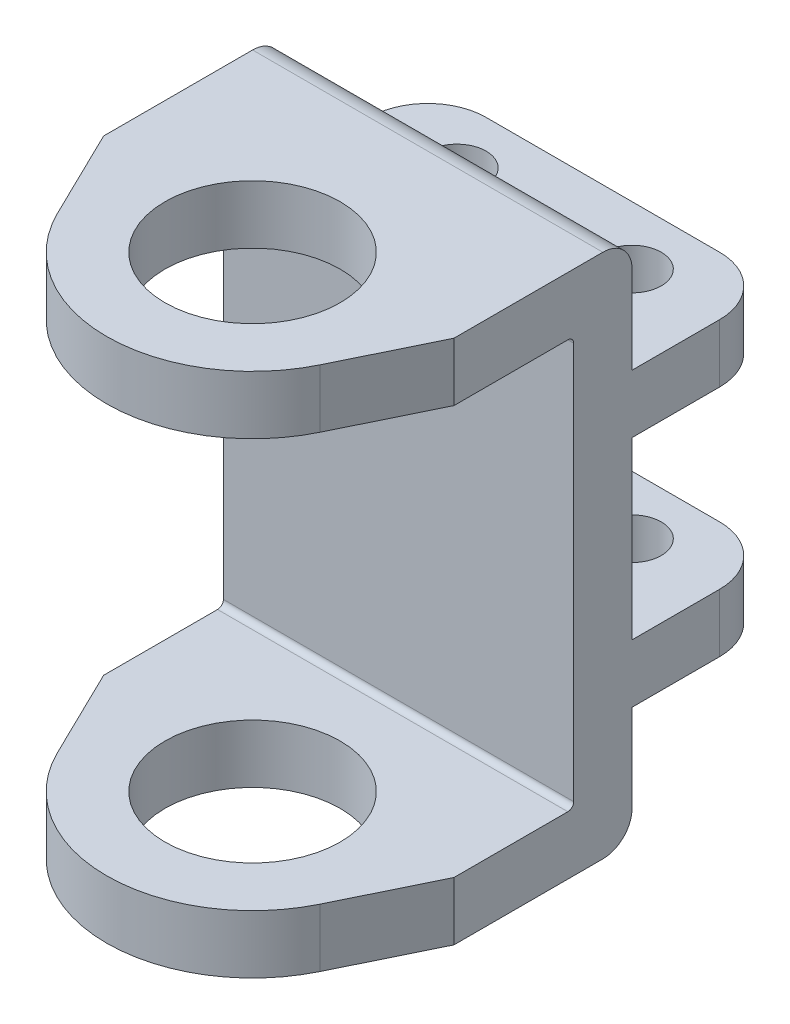
ISO-10303-21;
HEADER;
FILE_DESCRIPTION(('STEP AP214'),'2;1');
FILE_NAME('part.step','',(''),(''),'','','');
FILE_SCHEMA(('AUTOMOTIVE_DESIGN { 1 0 10303 214 1 1 1 1 }'));
ENDSEC;
DATA;
#1=APPLICATION_CONTEXT('core data for automotive mechanical design processes');
#2=APPLICATION_PROTOCOL_DEFINITION('international standard','automotive_design',2000,#1);
#3=PRODUCT_CONTEXT('',#1,'mechanical');
#4=PRODUCT('Part','Part','',(#3));
#5=PRODUCT_RELATED_PRODUCT_CATEGORY('part','',(#4));
#6=PRODUCT_DEFINITION_FORMATION('','',#4);
#7=PRODUCT_DEFINITION_CONTEXT('part definition',#1,'design');
#8=PRODUCT_DEFINITION('design','',#6,#7);
#9=PRODUCT_DEFINITION_SHAPE('','',#8);
#10=(LENGTH_UNIT() NAMED_UNIT(*) SI_UNIT(.MILLI.,.METRE.));
#11=(NAMED_UNIT(*) PLANE_ANGLE_UNIT() SI_UNIT($,.RADIAN.));
#12=(NAMED_UNIT(*) SI_UNIT($,.STERADIAN.) SOLID_ANGLE_UNIT());
#13=UNCERTAINTY_MEASURE_WITH_UNIT(LENGTH_MEASURE(1.E-05),#10,'distance_accuracy_value','');
#14=(GEOMETRIC_REPRESENTATION_CONTEXT(3) GLOBAL_UNCERTAINTY_ASSIGNED_CONTEXT((#13)) GLOBAL_UNIT_ASSIGNED_CONTEXT((#10,
#11,#12)) REPRESENTATION_CONTEXT('',''));
#15=CARTESIAN_POINT('',(0.,0.,0.));
#16=DIRECTION('',(0.,0.,1.));
#17=DIRECTION('',(1.,0.,0.));
#18=AXIS2_PLACEMENT_3D('',#15,#16,#17);
#19=CARTESIAN_POINT('',(20.0000000000001,90.,-32.5));
#20=DIRECTION('',(0.,-1.,0.));
#21=DIRECTION('',(0.,0.,-1.));
#22=AXIS2_PLACEMENT_3D('',#19,#20,#21);
#23=CYLINDRICAL_SURFACE('',#22,10.);
#24=DIRECTION('',(0.,-1.,0.));
#25=VECTOR('',#24,1.);
#26=CARTESIAN_POINT('',(20.,90.,-42.5));
#27=LINE('',#26,#25);
#28=CARTESIAN_POINT('',(20.,30.,-42.5));
#29=VERTEX_POINT('',#28);
#30=CARTESIAN_POINT('',(20.,20.,-42.5));
#31=VERTEX_POINT('',#30);
#32=EDGE_CURVE('E438',#29,#31,#27,.T.);
#33=ORIENTED_EDGE('',*,*,#32,.F.);
#34=CARTESIAN_POINT('',(20.0000000000001,30.,-32.5));
#35=DIRECTION('',(0.,-1.,0.));
#36=DIRECTION('',(0.,0.,-1.));
#37=AXIS2_PLACEMENT_3D('',#34,#35,#36);
#38=CIRCLE('',#37,10.);
#39=CARTESIAN_POINT('',(30.0000000000001,30.,-32.4999999999999));
#40=VERTEX_POINT('',#39);
#41=EDGE_CURVE('E378',#29,#40,#38,.T.);
#42=ORIENTED_EDGE('',*,*,#41,.T.);
#43=DIRECTION('',(0.,-1.,0.));
#44=VECTOR('',#43,1.);
#45=CARTESIAN_POINT('',(30.0000000000001,90.,-32.4999999999999));
#46=LINE('',#45,#44);
#47=CARTESIAN_POINT('',(30.0000000000001,20.,-32.4999999999999));
#48=VERTEX_POINT('',#47);
#49=EDGE_CURVE('E399',#40,#48,#46,.T.);
#50=ORIENTED_EDGE('',*,*,#49,.T.);
#51=CARTESIAN_POINT('',(20.0000000000001,20.,-32.5));
#52=DIRECTION('',(0.,1.,0.));
#53=DIRECTION('',(0.,0.,1.));
#54=AXIS2_PLACEMENT_3D('',#51,#52,#53);
#55=CIRCLE('',#54,10.);
#56=EDGE_CURVE('E358',#48,#31,#55,.T.);
#57=ORIENTED_EDGE('',*,*,#56,.T.);
#58=EDGE_LOOP('',(#33,#42,#50,#57));
#59=FACE_BOUND('',#58,.T.);
#60=ADVANCED_FACE('F34',(#59),#23,.T.);
#61=CARTESIAN_POINT('',(20.,90.,-42.5));
#62=DIRECTION('',(0.,0.,1.));
#63=DIRECTION('',(1.,0.,0.));
#64=AXIS2_PLACEMENT_3D('',#61,#62,#63);
#65=PLANE('',#64);
#66=DIRECTION('',(0.,-1.,0.));
#67=VECTOR('',#66,1.);
#68=CARTESIAN_POINT('',(-19.9999999999999,90.,-42.5));
#69=LINE('',#68,#67);
#70=CARTESIAN_POINT('',(-19.9999999999999,30.,-42.5));
#71=VERTEX_POINT('',#70);
#72=CARTESIAN_POINT('',(-19.9999999999999,20.,-42.5));
#73=VERTEX_POINT('',#72);
#74=EDGE_CURVE('E434',#71,#73,#69,.T.);
#75=ORIENTED_EDGE('',*,*,#74,.F.);
#76=DIRECTION('',(1.,0.,0.));
#77=VECTOR('',#76,1.);
#78=CARTESIAN_POINT('',(-30.,30.,-42.5));
#79=LINE('',#78,#77);
#80=EDGE_CURVE('E286',#71,#29,#79,.T.);
#81=ORIENTED_EDGE('',*,*,#80,.T.);
#82=ORIENTED_EDGE('',*,*,#32,.T.);
#83=DIRECTION('',(1.,0.,0.));
#84=VECTOR('',#83,1.);
#85=CARTESIAN_POINT('',(-30.,20.,-42.5));
#86=LINE('',#85,#84);
#87=EDGE_CURVE('E317',#73,#31,#86,.T.);
#88=ORIENTED_EDGE('',*,*,#87,.F.);
#89=EDGE_LOOP('',(#75,#81,#82,#88));
#90=FACE_BOUND('',#89,.T.);
#91=ADVANCED_FACE('F513',(#90),#65,.F.);
#92=CARTESIAN_POINT('',(-19.9999999999999,90.,-32.5));
#93=DIRECTION('',(0.,-1.,0.));
#94=DIRECTION('',(0.,0.,-1.));
#95=AXIS2_PLACEMENT_3D('',#92,#93,#94);
#96=CYLINDRICAL_SURFACE('',#95,10.);
#97=DIRECTION('',(0.,-1.,0.));
#98=VECTOR('',#97,1.);
#99=CARTESIAN_POINT('',(-29.9999999999999,90.,-32.4999999999999));
#100=LINE('',#99,#98);
#101=CARTESIAN_POINT('',(-30.,30.,-32.4999999999999));
#102=VERTEX_POINT('',#101);
#103=CARTESIAN_POINT('',(-30.,20.,-32.4999999999999));
#104=VERTEX_POINT('',#103);
#105=EDGE_CURVE('E430',#102,#104,#100,.T.);
#106=ORIENTED_EDGE('',*,*,#105,.F.);
#107=CARTESIAN_POINT('',(-19.9999999999999,30.,-32.5));
#108=DIRECTION('',(0.,-1.,0.));
#109=DIRECTION('',(0.,0.,-1.));
#110=AXIS2_PLACEMENT_3D('',#107,#108,#109);
#111=CIRCLE('',#110,10.);
#112=EDGE_CURVE('E375',#102,#71,#111,.T.);
#113=ORIENTED_EDGE('',*,*,#112,.T.);
#114=ORIENTED_EDGE('',*,*,#74,.T.);
#115=CARTESIAN_POINT('',(-19.9999999999999,20.,-32.5));
#116=DIRECTION('',(0.,1.,0.));
#117=DIRECTION('',(0.,0.,1.));
#118=AXIS2_PLACEMENT_3D('',#115,#116,#117);
#119=CIRCLE('',#118,10.);
#120=EDGE_CURVE('E355',#73,#104,#119,.T.);
#121=ORIENTED_EDGE('',*,*,#120,.T.);
#122=EDGE_LOOP('',(#106,#113,#114,#121));
#123=FACE_BOUND('',#122,.T.);
#124=ADVANCED_FACE('F507',(#123),#96,.T.);
#125=CARTESIAN_POINT('',(-30.,90.,13.012820512795));
#126=DIRECTION('',(0.898876404494167,0.,-0.438202247191452));
#127=DIRECTION('',(-0.438202247191452,0.,-0.898876404494168));
#128=AXIS2_PLACEMENT_3D('',#125,#126,#127);
#129=PLANE('',#128);
#130=DIRECTION('',(0.,-1.,0.));
#131=VECTOR('',#130,1.);
#132=CARTESIAN_POINT('',(-30.,90.,13.012820512795));
#133=LINE('',#132,#131);
#134=CARTESIAN_POINT('',(-30.,90.,13.012820512795));
#135=VERTEX_POINT('',#134);
#136=CARTESIAN_POINT('',(-30.0000000000001,80.,13.012820512795));
#137=VERTEX_POINT('',#136);
#138=EDGE_CURVE('E427',#135,#137,#133,.T.);
#139=ORIENTED_EDGE('',*,*,#138,.T.);
#140=DIRECTION('',(0.438202247191452,0.,0.898876404494168));
#141=VECTOR('',#140,1.);
#142=CARTESIAN_POINT('',(-30.,80.,13.012820512795));
#143=LINE('',#142,#141);
#144=CARTESIAN_POINT('',(-22.4719101123365,80.,28.4550561797778));
#145=VERTEX_POINT('',#144);
#146=EDGE_CURVE('E338',#137,#145,#143,.T.);
#147=ORIENTED_EDGE('',*,*,#146,.T.);
#148=DIRECTION('',(0.,-1.,0.));
#149=VECTOR('',#148,1.);
#150=CARTESIAN_POINT('',(-22.4719101123365,90.,28.4550561797778));
#151=LINE('',#150,#149);
#152=CARTESIAN_POINT('',(-22.4719101123365,90.,28.4550561797778));
#153=VERTEX_POINT('',#152);
#154=EDGE_CURVE('E424',#153,#145,#151,.T.);
#155=ORIENTED_EDGE('',*,*,#154,.F.);
#156=DIRECTION('',(0.438202247191452,0.,0.898876404494167));
#157=VECTOR('',#156,1.);
#158=CARTESIAN_POINT('',(-30.,90.,13.012820512795));
#159=LINE('',#158,#157);
#160=EDGE_CURVE('E390',#135,#153,#159,.T.);
#161=ORIENTED_EDGE('',*,*,#160,.F.);
#162=EDGE_LOOP('',(#139,#147,#155,#161));
#163=FACE_BOUND('',#162,.T.);
#164=ADVANCED_FACE('F559',(#163),#129,.F.);
#165=CARTESIAN_POINT('',(0.,90.,17.5000000000001));
#166=DIRECTION('',(0.,-1.,0.));
#167=DIRECTION('',(0.,0.,-1.));
#168=AXIS2_PLACEMENT_3D('',#165,#166,#167);
#169=CYLINDRICAL_SURFACE('',#168,24.9999999999804);
#170=CARTESIAN_POINT('',(0.,80.,17.5000000000001));
#171=DIRECTION('',(0.,1.,0.));
#172=DIRECTION('',(0.,0.,1.));
#173=AXIS2_PLACEMENT_3D('',#170,#171,#172);
#174=CIRCLE('',#173,24.9999999999804);
#175=CARTESIAN_POINT('',(22.4719101123366,80.,28.4550561797778));
#176=VERTEX_POINT('',#175);
#177=EDGE_CURVE('E336',#145,#176,#174,.T.);
#178=ORIENTED_EDGE('',*,*,#177,.T.);
#179=DIRECTION('',(0.,-1.,0.));
#180=VECTOR('',#179,1.);
#181=CARTESIAN_POINT('',(22.4719101123366,90.,28.4550561797778));
#182=LINE('',#181,#180);
#183=CARTESIAN_POINT('',(22.4719101123366,90.,28.4550561797778));
#184=VERTEX_POINT('',#183);
#185=EDGE_CURVE('E420',#184,#176,#182,.T.);
#186=ORIENTED_EDGE('',*,*,#185,.F.);
#187=CARTESIAN_POINT('',(0.,90.,17.5000000000001));
#188=DIRECTION('',(0.,1.,0.));
#189=DIRECTION('',(0.,0.,1.));
#190=AXIS2_PLACEMENT_3D('',#187,#188,#189);
#191=CIRCLE('',#190,24.9999999999804);
#192=EDGE_CURVE('E393',#153,#184,#191,.T.);
#193=ORIENTED_EDGE('',*,*,#192,.F.);
#194=ORIENTED_EDGE('',*,*,#154,.T.);
#195=EDGE_LOOP('',(#178,#186,#193,#194));
#196=FACE_BOUND('',#195,.T.);
#197=ADVANCED_FACE('F563',(#196),#169,.T.);
#198=CARTESIAN_POINT('',(30.0000000000001,90.,13.012820512795));
#199=DIRECTION('',(-0.898876404494167,0.,-0.438202247191452));
#200=DIRECTION('',(-0.438202247191452,0.,0.898876404494167));
#201=AXIS2_PLACEMENT_3D('',#198,#199,#200);
#202=PLANE('',#201);
#203=ORIENTED_EDGE('',*,*,#185,.T.);
#204=DIRECTION('',(0.438202247191452,0.,-0.898876404494167));
#205=VECTOR('',#204,1.);
#206=CARTESIAN_POINT('',(30.0000000000001,80.,13.012820512795));
#207=LINE('',#206,#205);
#208=CARTESIAN_POINT('',(30.,80.,13.012820512795));
#209=VERTEX_POINT('',#208);
#210=EDGE_CURVE('E333',#176,#209,#207,.T.);
#211=ORIENTED_EDGE('',*,*,#210,.T.);
#212=DIRECTION('',(0.,-1.,0.));
#213=VECTOR('',#212,1.);
#214=CARTESIAN_POINT('',(30.0000000000001,90.,13.012820512795));
#215=LINE('',#214,#213);
#216=CARTESIAN_POINT('',(30.0000000000001,90.,13.012820512795));
#217=VERTEX_POINT('',#216);
#218=EDGE_CURVE('E415',#217,#209,#215,.T.);
#219=ORIENTED_EDGE('',*,*,#218,.F.);
#220=DIRECTION('',(0.438202247191452,0.,-0.898876404494167));
#221=VECTOR('',#220,1.);
#222=CARTESIAN_POINT('',(30.0000000000001,90.,13.012820512795));
#223=LINE('',#222,#221);
#224=EDGE_CURVE('E395',#184,#217,#223,.T.);
#225=ORIENTED_EDGE('',*,*,#224,.F.);
#226=EDGE_LOOP('',(#203,#211,#219,#225));
#227=FACE_BOUND('',#226,.T.);
#228=ADVANCED_FACE('F598',(#227),#202,.F.);
#229=CARTESIAN_POINT('',(0.,90.,17.5000000000001));
#230=DIRECTION('',(0.,-1.,0.));
#231=DIRECTION('',(0.,0.,-1.));
#232=AXIS2_PLACEMENT_3D('',#229,#230,#231);
#233=CYLINDRICAL_SURFACE('',#232,15.);
#234=CARTESIAN_POINT('',(0.,80.,17.5000000000001));
#235=DIRECTION('',(0.,1.,0.));
#236=DIRECTION('',(0.,0.,1.));
#237=AXIS2_PLACEMENT_3D('',#234,#235,#236);
#238=CIRCLE('',#237,15.);
#239=CARTESIAN_POINT('',(0.,80.,32.5000000000001));
#240=VERTEX_POINT('',#239);
#241=EDGE_CURVE('E332',#240,#240,#238,.T.);
#242=ORIENTED_EDGE('',*,*,#241,.F.);
#243=EDGE_LOOP('',(#242));
#244=FACE_BOUND('',#243,.T.);
#245=CARTESIAN_POINT('',(0.,90.,17.5000000000001));
#246=DIRECTION('',(0.,1.,0.));
#247=DIRECTION('',(0.,0.,1.));
#248=AXIS2_PLACEMENT_3D('',#245,#246,#247);
#249=CIRCLE('',#248,15.);
#250=CARTESIAN_POINT('',(0.,90.,32.5000000000001));
#251=VERTEX_POINT('',#250);
#252=EDGE_CURVE('E382',#251,#251,#249,.T.);
#253=ORIENTED_EDGE('',*,*,#252,.T.);
#254=EDGE_LOOP('',(#253));
#255=FACE_BOUND('',#254,.T.);
#256=ADVANCED_FACE('F589',(#244,#255),#233,.F.);
#257=CARTESIAN_POINT('',(20.0000000000001,90.,-32.5));
#258=DIRECTION('',(0.,1.,0.));
#259=DIRECTION('',(0.,0.,1.));
#260=AXIS2_PLACEMENT_3D('',#257,#258,#259);
#261=PLANE('',#260);
#262=DIRECTION('',(0.,0.,-1.));
#263=VECTOR('',#262,1.);
#264=CARTESIAN_POINT('',(30.,90.,0.));
#265=LINE('',#264,#263);
#266=CARTESIAN_POINT('',(30.,90.,-12.4999999999999));
#267=VERTEX_POINT('',#266);
#268=EDGE_CURVE('E397',#217,#267,#265,.T.);
#269=ORIENTED_EDGE('',*,*,#268,.T.);
#270=DIRECTION('',(1.,0.,0.));
#271=VECTOR('',#270,1.);
#272=CARTESIAN_POINT('',(-30.,90.,-12.5));
#273=LINE('',#272,#271);
#274=CARTESIAN_POINT('',(-30.,90.,-12.5));
#275=VERTEX_POINT('',#274);
#276=EDGE_CURVE('E11',#267,#275,#273,.F.);
#277=ORIENTED_EDGE('',*,*,#276,.T.);
#278=DIRECTION('',(0.,0.,1.));
#279=VECTOR('',#278,1.);
#280=CARTESIAN_POINT('',(-30.,90.,0.));
#281=LINE('',#280,#279);
#282=EDGE_CURVE('E388',#275,#135,#281,.T.);
#283=ORIENTED_EDGE('',*,*,#282,.T.);
#284=ORIENTED_EDGE('',*,*,#160,.T.);
#285=ORIENTED_EDGE('',*,*,#192,.T.);
#286=ORIENTED_EDGE('',*,*,#224,.T.);
#287=EDGE_LOOP('',(#269,#277,#283,#284,#285,#286));
#288=FACE_BOUND('',#287,.T.);
#289=ORIENTED_EDGE('',*,*,#252,.F.);
#290=EDGE_LOOP('',(#289));
#291=FACE_BOUND('',#290,.T.);
#292=ADVANCED_FACE('F566',(#288,#291),#261,.T.);
#293=CARTESIAN_POINT('',(20.0000000000001,0.,-32.5));
#294=DIRECTION('',(0.,1.,0.));
#295=DIRECTION('',(0.,0.,1.));
#296=AXIS2_PLACEMENT_3D('',#293,#294,#295);
#297=PLANE('',#296);
#298=DIRECTION('',(0.,0.,1.));
#299=VECTOR('',#298,1.);
#300=CARTESIAN_POINT('',(-30.,0.,0.));
#301=LINE('',#300,#299);
#302=CARTESIAN_POINT('',(-30.,0.,-12.5));
#303=VERTEX_POINT('',#302);
#304=CARTESIAN_POINT('',(-30.,0.,13.012820512795));
#305=VERTEX_POINT('',#304);
#306=EDGE_CURVE('E385',#303,#305,#301,.T.);
#307=ORIENTED_EDGE('',*,*,#306,.F.);
#308=DIRECTION('',(1.,0.,0.));
#309=VECTOR('',#308,1.);
#310=CARTESIAN_POINT('',(20.,0.,-12.4999999999999));
#311=LINE('',#310,#309);
#312=CARTESIAN_POINT('',(30.,0.,-12.4999999999999));
#313=VERTEX_POINT('',#312);
#314=EDGE_CURVE('E454',#303,#313,#311,.T.);
#315=ORIENTED_EDGE('',*,*,#314,.T.);
#316=DIRECTION('',(0.,0.,-1.));
#317=VECTOR('',#316,1.);
#318=CARTESIAN_POINT('',(30.,0.,0.));
#319=LINE('',#318,#317);
#320=CARTESIAN_POINT('',(30.0000000000001,0.,13.012820512795));
#321=VERTEX_POINT('',#320);
#322=EDGE_CURVE('E391',#321,#313,#319,.T.);
#323=ORIENTED_EDGE('',*,*,#322,.F.);
#324=DIRECTION('',(0.438202247191452,0.,-0.898876404494167));
#325=VECTOR('',#324,1.);
#326=CARTESIAN_POINT('',(30.0000000000001,0.,13.012820512795));
#327=LINE('',#326,#325);
#328=CARTESIAN_POINT('',(22.4719101123366,0.,28.4550561797778));
#329=VERTEX_POINT('',#328);
#330=EDGE_CURVE('E407',#329,#321,#327,.T.);
#331=ORIENTED_EDGE('',*,*,#330,.F.);
#332=CARTESIAN_POINT('',(0.,0.,17.5000000000001));
#333=DIRECTION('',(0.,1.,0.));
#334=DIRECTION('',(0.,0.,1.));
#335=AXIS2_PLACEMENT_3D('',#332,#333,#334);
#336=CIRCLE('',#335,24.9999999999804);
#337=CARTESIAN_POINT('',(-22.4719101123365,0.,28.4550561797778));
#338=VERTEX_POINT('',#337);
#339=EDGE_CURVE('E404',#338,#329,#336,.T.);
#340=ORIENTED_EDGE('',*,*,#339,.F.);
#341=DIRECTION('',(0.438202247191452,0.,0.898876404494167));
#342=VECTOR('',#341,1.);
#343=CARTESIAN_POINT('',(-30.,0.,13.012820512795));
#344=LINE('',#343,#342);
#345=EDGE_CURVE('E401',#305,#338,#344,.T.);
#346=ORIENTED_EDGE('',*,*,#345,.F.);
#347=EDGE_LOOP('',(#307,#315,#323,#331,#340,#346));
#348=FACE_BOUND('',#347,.T.);
#349=CARTESIAN_POINT('',(0.,0.,17.5000000000001));
#350=DIRECTION('',(0.,1.,0.));
#351=DIRECTION('',(0.,0.,1.));
#352=AXIS2_PLACEMENT_3D('',#349,#350,#351);
#353=CIRCLE('',#352,15.);
#354=CARTESIAN_POINT('',(0.,0.,32.5000000000001));
#355=VERTEX_POINT('',#354);
#356=EDGE_CURVE('E381',#355,#355,#353,.T.);
#357=ORIENTED_EDGE('',*,*,#356,.T.);
#358=EDGE_LOOP('',(#357));
#359=FACE_BOUND('',#358,.T.);
#360=ADVANCED_FACE('F530',(#348,#359),#297,.F.);
#361=CARTESIAN_POINT('',(30.0000000000001,70.,-32.4999999999999));
#362=VERTEX_POINT('',#361);
#363=CARTESIAN_POINT('',(30.0000000000001,60.,-32.4999999999999));
#364=VERTEX_POINT('',#363);
#365=EDGE_CURVE('E414',#362,#364,#46,.T.);
#366=ORIENTED_EDGE('',*,*,#365,.T.);
#367=CARTESIAN_POINT('',(20.0000000000001,60.,-32.5));
#368=DIRECTION('',(0.,1.,0.));
#369=DIRECTION('',(0.,0.,1.));
#370=AXIS2_PLACEMENT_3D('',#367,#368,#369);
#371=CIRCLE('',#370,10.);
#372=CARTESIAN_POINT('',(20.,60.,-42.5));
#373=VERTEX_POINT('',#372);
#374=EDGE_CURVE('E368',#364,#373,#371,.T.);
#375=ORIENTED_EDGE('',*,*,#374,.T.);
#376=CARTESIAN_POINT('',(20.,70.,-42.5));
#377=VERTEX_POINT('',#376);
#378=EDGE_CURVE('E441',#377,#373,#27,.T.);
#379=ORIENTED_EDGE('',*,*,#378,.F.);
#380=CARTESIAN_POINT('',(20.0000000000001,70.,-32.5));
#381=DIRECTION('',(0.,-1.,0.));
#382=DIRECTION('',(0.,0.,-1.));
#383=AXIS2_PLACEMENT_3D('',#380,#381,#382);
#384=CIRCLE('',#383,10.);
#385=EDGE_CURVE('E348',#377,#362,#384,.T.);
#386=ORIENTED_EDGE('',*,*,#385,.T.);
#387=EDGE_LOOP('',(#366,#375,#379,#386));
#388=FACE_BOUND('',#387,.T.);
#389=ADVANCED_FACE('F484',(#388),#23,.T.);
#390=ORIENTED_EDGE('',*,*,#378,.T.);
#391=DIRECTION('',(1.,0.,0.));
#392=VECTOR('',#391,1.);
#393=CARTESIAN_POINT('',(-30.,60.,-42.5));
#394=LINE('',#393,#392);
#395=CARTESIAN_POINT('',(-19.9999999999999,60.,-42.5));
#396=VERTEX_POINT('',#395);
#397=EDGE_CURVE('E279',#396,#373,#394,.T.);
#398=ORIENTED_EDGE('',*,*,#397,.F.);
#399=CARTESIAN_POINT('',(-19.9999999999999,70.,-42.5));
#400=VERTEX_POINT('',#399);
#401=EDGE_CURVE('E437',#400,#396,#69,.T.);
#402=ORIENTED_EDGE('',*,*,#401,.F.);
#403=DIRECTION('',(1.,0.,0.));
#404=VECTOR('',#403,1.);
#405=CARTESIAN_POINT('',(-30.,70.,-42.5));
#406=LINE('',#405,#404);
#407=EDGE_CURVE('E256',#400,#377,#406,.T.);
#408=ORIENTED_EDGE('',*,*,#407,.T.);
#409=EDGE_LOOP('',(#390,#398,#402,#408));
#410=FACE_BOUND('',#409,.T.);
#411=ADVANCED_FACE('F488',(#410),#65,.F.);
#412=ORIENTED_EDGE('',*,*,#401,.T.);
#413=CARTESIAN_POINT('',(-19.9999999999999,60.,-32.5));
#414=DIRECTION('',(0.,1.,0.));
#415=DIRECTION('',(0.,0.,1.));
#416=AXIS2_PLACEMENT_3D('',#413,#414,#415);
#417=CIRCLE('',#416,10.);
#418=CARTESIAN_POINT('',(-30.,60.,-32.4999999999999));
#419=VERTEX_POINT('',#418);
#420=EDGE_CURVE('E365',#396,#419,#417,.T.);
#421=ORIENTED_EDGE('',*,*,#420,.T.);
#422=CARTESIAN_POINT('',(-30.,70.,-32.4999999999999));
#423=VERTEX_POINT('',#422);
#424=EDGE_CURVE('E433',#423,#419,#100,.T.);
#425=ORIENTED_EDGE('',*,*,#424,.F.);
#426=CARTESIAN_POINT('',(-19.9999999999999,70.,-32.5));
#427=DIRECTION('',(0.,-1.,0.));
#428=DIRECTION('',(0.,0.,-1.));
#429=AXIS2_PLACEMENT_3D('',#426,#427,#428);
#430=CIRCLE('',#429,10.);
#431=EDGE_CURVE('E345',#423,#400,#430,.T.);
#432=ORIENTED_EDGE('',*,*,#431,.T.);
#433=EDGE_LOOP('',(#412,#421,#425,#432));
#434=FACE_BOUND('',#433,.T.);
#435=ADVANCED_FACE('F493',(#434),#96,.T.);
#436=CARTESIAN_POINT('',(-30.,90.,0.));
#437=DIRECTION('',(1.,0.,0.));
#438=DIRECTION('',(0.,0.,-1.));
#439=AXIS2_PLACEMENT_3D('',#436,#437,#438);
#440=PLANE('',#439);
#441=DIRECTION('',(0.,-1.,0.));
#442=VECTOR('',#441,1.);
#443=CARTESIAN_POINT('',(-30.,0.,-17.5));
#444=LINE('',#443,#442);
#445=CARTESIAN_POINT('',(-30.,20.,-17.5));
#446=VERTEX_POINT('',#445);
#447=CARTESIAN_POINT('',(-30.,5.,-17.5));
#448=VERTEX_POINT('',#447);
#449=EDGE_CURVE('E314',#446,#448,#444,.T.);
#450=ORIENTED_EDGE('',*,*,#449,.T.);
#451=CARTESIAN_POINT('',(-30.,5.,-12.5));
#452=DIRECTION('',(1.,0.,0.));
#453=DIRECTION('',(0.,0.,-1.));
#454=AXIS2_PLACEMENT_3D('',#451,#452,#453);
#455=CIRCLE('',#454,5.);
#456=EDGE_CURVE('E464',#448,#303,#455,.F.);
#457=ORIENTED_EDGE('',*,*,#456,.T.);
#458=ORIENTED_EDGE('',*,*,#306,.T.);
#459=CARTESIAN_POINT('',(-30.0000000000001,9.99999999999999,13.012820512795));
#460=VERTEX_POINT('',#459);
#461=EDGE_CURVE('E242',#460,#305,#133,.T.);
#462=ORIENTED_EDGE('',*,*,#461,.F.);
#463=DIRECTION('',(0.,0.,-1.));
#464=VECTOR('',#463,1.);
#465=CARTESIAN_POINT('',(-30.0000000000001,9.99999999999999,42.4999999999804));
#466=LINE('',#465,#464);
#467=CARTESIAN_POINT('',(-30.,9.99999999999999,-6.50000000001957));
#468=VERTEX_POINT('',#467);
#469=EDGE_CURVE('E221',#460,#468,#466,.T.);
#470=ORIENTED_EDGE('',*,*,#469,.T.);
#471=CARTESIAN_POINT('',(-30.,11.,-6.50000000001958));
#472=DIRECTION('',(1.,0.,0.));
#473=DIRECTION('',(0.,0.,1.));
#474=AXIS2_PLACEMENT_3D('',#471,#472,#473);
#475=CIRCLE('',#474,1.);
#476=CARTESIAN_POINT('',(-30.,11.,-7.50000000001958));
#477=VERTEX_POINT('',#476);
#478=EDGE_CURVE('E232',#468,#477,#475,.T.);
#479=ORIENTED_EDGE('',*,*,#478,.T.);
#480=DIRECTION('',(0.,1.,0.));
#481=VECTOR('',#480,1.);
#482=CARTESIAN_POINT('',(-30.,79.,-7.50000000001957));
#483=LINE('',#482,#481);
#484=CARTESIAN_POINT('',(-30.,79.,-7.50000000001957));
#485=VERTEX_POINT('',#484);
#486=EDGE_CURVE('E236',#477,#485,#483,.T.);
#487=ORIENTED_EDGE('',*,*,#486,.T.);
#488=CARTESIAN_POINT('',(-30.,79.,-6.50000000001957));
#489=DIRECTION('',(1.,0.,0.));
#490=DIRECTION('',(0.,0.,-1.));
#491=AXIS2_PLACEMENT_3D('',#488,#489,#490);
#492=CIRCLE('',#491,1.);
#493=CARTESIAN_POINT('',(-30.,80.,-6.50000000001956));
#494=VERTEX_POINT('',#493);
#495=EDGE_CURVE('E249',#485,#494,#492,.T.);
#496=ORIENTED_EDGE('',*,*,#495,.T.);
#497=DIRECTION('',(0.,0.,1.));
#498=VECTOR('',#497,1.);
#499=CARTESIAN_POINT('',(-30.0000000000001,80.,42.4999999999804));
#500=LINE('',#499,#498);
#501=EDGE_CURVE('E229',#494,#137,#500,.T.);
#502=ORIENTED_EDGE('',*,*,#501,.T.);
#503=ORIENTED_EDGE('',*,*,#138,.F.);
#504=ORIENTED_EDGE('',*,*,#282,.F.);
#505=CARTESIAN_POINT('',(-30.,85.,-12.5));
#506=DIRECTION('',(1.,0.,0.));
#507=DIRECTION('',(0.,0.,-1.));
#508=AXIS2_PLACEMENT_3D('',#505,#506,#507);
#509=CIRCLE('',#508,5.);
#510=CARTESIAN_POINT('',(-30.,85.,-17.5));
#511=VERTEX_POINT('',#510);
#512=EDGE_CURVE('E49',#275,#511,#509,.F.);
#513=ORIENTED_EDGE('',*,*,#512,.T.);
#514=DIRECTION('',(0.,-1.,0.));
#515=VECTOR('',#514,1.);
#516=CARTESIAN_POINT('',(-30.,90.,-17.5));
#517=LINE('',#516,#515);
#518=CARTESIAN_POINT('',(-30.,70.,-17.5));
#519=VERTEX_POINT('',#518);
#520=EDGE_CURVE('E296',#511,#519,#517,.T.);
#521=ORIENTED_EDGE('',*,*,#520,.T.);
#522=DIRECTION('',(0.,0.,-1.));
#523=VECTOR('',#522,1.);
#524=CARTESIAN_POINT('',(-30.,70.,-17.5));
#525=LINE('',#524,#523);
#526=EDGE_CURVE('E298',#519,#423,#525,.T.);
#527=ORIENTED_EDGE('',*,*,#526,.T.);
#528=ORIENTED_EDGE('',*,*,#424,.T.);
#529=DIRECTION('',(0.,0.,1.));
#530=VECTOR('',#529,1.);
#531=CARTESIAN_POINT('',(-30.,60.,-42.5));
#532=LINE('',#531,#530);
#533=CARTESIAN_POINT('',(-30.,60.,-17.5));
#534=VERTEX_POINT('',#533);
#535=EDGE_CURVE('E269',#419,#534,#532,.T.);
#536=ORIENTED_EDGE('',*,*,#535,.T.);
#537=DIRECTION('',(0.,-1.,0.));
#538=VECTOR('',#537,1.);
#539=CARTESIAN_POINT('',(-30.,60.,-17.5));
#540=LINE('',#539,#538);
#541=CARTESIAN_POINT('',(-30.,30.,-17.5));
#542=VERTEX_POINT('',#541);
#543=EDGE_CURVE('E272',#534,#542,#540,.T.);
#544=ORIENTED_EDGE('',*,*,#543,.T.);
#545=DIRECTION('',(0.,0.,-1.));
#546=VECTOR('',#545,1.);
#547=CARTESIAN_POINT('',(-30.,30.,-42.5));
#548=LINE('',#547,#546);
#549=EDGE_CURVE('E276',#542,#102,#548,.T.);
#550=ORIENTED_EDGE('',*,*,#549,.T.);
#551=ORIENTED_EDGE('',*,*,#105,.T.);
#552=DIRECTION('',(0.,0.,1.));
#553=VECTOR('',#552,1.);
#554=CARTESIAN_POINT('',(-30.,20.,-42.5));
#555=LINE('',#554,#553);
#556=EDGE_CURVE('E311',#104,#446,#555,.T.);
#557=ORIENTED_EDGE('',*,*,#556,.T.);
#558=EDGE_LOOP('',(#450,#457,#458,#462,#470,#479,#487,#496,#502,#503,#504,#513,#521,#527,#528,
#536,#544,#550,#551,#557));
#559=FACE_BOUND('',#558,.T.);
#560=ADVANCED_FACE('F240',(#559),#440,.F.);
#561=CARTESIAN_POINT('',(-22.4719101123365,9.99999999999999,28.4550561797778));
#562=VERTEX_POINT('',#561);
#563=EDGE_CURVE('E423',#562,#338,#151,.T.);
#564=ORIENTED_EDGE('',*,*,#563,.F.);
#565=DIRECTION('',(-0.438202247191452,0.,-0.898876404494168));
#566=VECTOR('',#565,1.);
#567=CARTESIAN_POINT('',(-30.,9.99999999999999,13.012820512795));
#568=LINE('',#567,#566);
#569=EDGE_CURVE('E330',#562,#460,#568,.T.);
#570=ORIENTED_EDGE('',*,*,#569,.T.);
#571=ORIENTED_EDGE('',*,*,#461,.T.);
#572=ORIENTED_EDGE('',*,*,#345,.T.);
#573=EDGE_LOOP('',(#564,#570,#571,#572));
#574=FACE_BOUND('',#573,.T.);
#575=ADVANCED_FACE('F537',(#574),#129,.F.);
#576=CARTESIAN_POINT('',(22.4719101123366,9.99999999999999,28.4550561797778));
#577=VERTEX_POINT('',#576);
#578=EDGE_CURVE('E418',#577,#329,#182,.T.);
#579=ORIENTED_EDGE('',*,*,#578,.F.);
#580=CARTESIAN_POINT('',(0.,9.99999999999999,17.5000000000001));
#581=DIRECTION('',(0.,-1.,0.));
#582=DIRECTION('',(0.,0.,-1.));
#583=AXIS2_PLACEMENT_3D('',#580,#581,#582);
#584=CIRCLE('',#583,24.9999999999804);
#585=EDGE_CURVE('E327',#577,#562,#584,.T.);
#586=ORIENTED_EDGE('',*,*,#585,.T.);
#587=ORIENTED_EDGE('',*,*,#563,.T.);
#588=ORIENTED_EDGE('',*,*,#339,.T.);
#589=EDGE_LOOP('',(#579,#586,#587,#588));
#590=FACE_BOUND('',#589,.T.);
#591=ADVANCED_FACE('F540',(#590),#169,.T.);
#592=CARTESIAN_POINT('',(30.0000000000001,10.,13.012820512795));
#593=VERTEX_POINT('',#592);
#594=EDGE_CURVE('E419',#593,#321,#215,.T.);
#595=ORIENTED_EDGE('',*,*,#594,.F.);
#596=DIRECTION('',(-0.438202247191452,0.,0.898876404494167));
#597=VECTOR('',#596,1.);
#598=CARTESIAN_POINT('',(30.0000000000001,9.99999999999999,13.012820512795));
#599=LINE('',#598,#597);
#600=EDGE_CURVE('E324',#593,#577,#599,.T.);
#601=ORIENTED_EDGE('',*,*,#600,.T.);
#602=ORIENTED_EDGE('',*,*,#578,.T.);
#603=ORIENTED_EDGE('',*,*,#330,.T.);
#604=EDGE_LOOP('',(#595,#601,#602,#603));
#605=FACE_BOUND('',#604,.T.);
#606=ADVANCED_FACE('F543',(#605),#202,.F.);
#607=CARTESIAN_POINT('',(30.,90.,0.));
#608=DIRECTION('',(-1.,0.,0.));
#609=DIRECTION('',(0.,0.,1.));
#610=AXIS2_PLACEMENT_3D('',#607,#608,#609);
#611=PLANE('',#610);
#612=ORIENTED_EDGE('',*,*,#322,.T.);
#613=CARTESIAN_POINT('',(30.,5.,-12.4999999999999));
#614=DIRECTION('',(-1.,0.,0.));
#615=DIRECTION('',(0.,0.,1.));
#616=AXIS2_PLACEMENT_3D('',#613,#614,#615);
#617=CIRCLE('',#616,5.);
#618=CARTESIAN_POINT('',(30.,5.,-17.4999999999999));
#619=VERTEX_POINT('',#618);
#620=EDGE_CURVE('E459',#313,#619,#617,.F.);
#621=ORIENTED_EDGE('',*,*,#620,.T.);
#622=DIRECTION('',(0.,-1.,0.));
#623=VECTOR('',#622,1.);
#624=CARTESIAN_POINT('',(30.,0.,-17.4999999999999));
#625=LINE('',#624,#623);
#626=CARTESIAN_POINT('',(30.,20.,-17.4999999999999));
#627=VERTEX_POINT('',#626);
#628=EDGE_CURVE('E315',#627,#619,#625,.T.);
#629=ORIENTED_EDGE('',*,*,#628,.F.);
#630=DIRECTION('',(0.,0.,1.));
#631=VECTOR('',#630,1.);
#632=CARTESIAN_POINT('',(30.0000000000001,20.,-42.4999999999999));
#633=LINE('',#632,#631);
#634=EDGE_CURVE('E289',#48,#627,#633,.T.);
#635=ORIENTED_EDGE('',*,*,#634,.F.);
#636=ORIENTED_EDGE('',*,*,#49,.F.);
#637=DIRECTION('',(0.,0.,-1.));
#638=VECTOR('',#637,1.);
#639=CARTESIAN_POINT('',(30.0000000000001,30.,-42.5));
#640=LINE('',#639,#638);
#641=CARTESIAN_POINT('',(30.,30.,-17.4999999999999));
#642=VERTEX_POINT('',#641);
#643=EDGE_CURVE('E273',#642,#40,#640,.T.);
#644=ORIENTED_EDGE('',*,*,#643,.F.);
#645=DIRECTION('',(0.,-1.,0.));
#646=VECTOR('',#645,1.);
#647=CARTESIAN_POINT('',(30.,60.,-17.4999999999999));
#648=LINE('',#647,#646);
#649=CARTESIAN_POINT('',(30.,60.,-17.4999999999999));
#650=VERTEX_POINT('',#649);
#651=EDGE_CURVE('E282',#650,#642,#648,.T.);
#652=ORIENTED_EDGE('',*,*,#651,.F.);
#653=DIRECTION('',(0.,0.,1.));
#654=VECTOR('',#653,1.);
#655=CARTESIAN_POINT('',(30.0000000000001,60.,-42.4999999999999));
#656=LINE('',#655,#654);
#657=EDGE_CURVE('E280',#364,#650,#656,.T.);
#658=ORIENTED_EDGE('',*,*,#657,.F.);
#659=ORIENTED_EDGE('',*,*,#365,.F.);
#660=DIRECTION('',(0.,0.,-1.));
#661=VECTOR('',#660,1.);
#662=CARTESIAN_POINT('',(30.,70.,-17.4999999999999));
#663=LINE('',#662,#661);
#664=CARTESIAN_POINT('',(30.,70.,-17.4999999999999));
#665=VERTEX_POINT('',#664);
#666=EDGE_CURVE('E299',#665,#362,#663,.T.);
#667=ORIENTED_EDGE('',*,*,#666,.F.);
#668=DIRECTION('',(0.,-1.,0.));
#669=VECTOR('',#668,1.);
#670=CARTESIAN_POINT('',(30.,90.,-17.4999999999999));
#671=LINE('',#670,#669);
#672=CARTESIAN_POINT('',(30.,85.,-17.4999999999999));
#673=VERTEX_POINT('',#672);
#674=EDGE_CURVE('E303',#673,#665,#671,.T.);
#675=ORIENTED_EDGE('',*,*,#674,.F.);
#676=CARTESIAN_POINT('',(30.,85.,-12.4999999999999));
#677=DIRECTION('',(-1.,0.,0.));
#678=DIRECTION('',(0.,0.,1.));
#679=AXIS2_PLACEMENT_3D('',#676,#677,#678);
#680=CIRCLE('',#679,5.);
#681=EDGE_CURVE('E457',#673,#267,#680,.F.);
#682=ORIENTED_EDGE('',*,*,#681,.T.);
#683=ORIENTED_EDGE('',*,*,#268,.F.);
#684=ORIENTED_EDGE('',*,*,#218,.T.);
#685=DIRECTION('',(0.,0.,1.));
#686=VECTOR('',#685,1.);
#687=CARTESIAN_POINT('',(30.,80.,42.4999999999805));
#688=LINE('',#687,#686);
#689=CARTESIAN_POINT('',(30.,80.,-6.50000000001947));
#690=VERTEX_POINT('',#689);
#691=EDGE_CURVE('E243',#690,#209,#688,.T.);
#692=ORIENTED_EDGE('',*,*,#691,.F.);
#693=CARTESIAN_POINT('',(30.,79.,-6.50000000001948));
#694=DIRECTION('',(1.,0.,0.));
#695=DIRECTION('',(0.,0.,-1.));
#696=AXIS2_PLACEMENT_3D('',#693,#694,#695);
#697=CIRCLE('',#696,1.);
#698=CARTESIAN_POINT('',(30.,79.,-7.50000000001948));
#699=VERTEX_POINT('',#698);
#700=EDGE_CURVE('E245',#699,#690,#697,.T.);
#701=ORIENTED_EDGE('',*,*,#700,.F.);
#702=DIRECTION('',(0.,1.,0.));
#703=VECTOR('',#702,1.);
#704=CARTESIAN_POINT('',(30.,79.,-7.50000000001948));
#705=LINE('',#704,#703);
#706=CARTESIAN_POINT('',(30.,11.,-7.50000000001949));
#707=VERTEX_POINT('',#706);
#708=EDGE_CURVE('E258',#707,#699,#705,.T.);
#709=ORIENTED_EDGE('',*,*,#708,.F.);
#710=CARTESIAN_POINT('',(30.,11.,-6.50000000001949));
#711=DIRECTION('',(1.,0.,0.));
#712=DIRECTION('',(0.,0.,1.));
#713=AXIS2_PLACEMENT_3D('',#710,#711,#712);
#714=CIRCLE('',#713,1.);
#715=CARTESIAN_POINT('',(30.,9.99999999999999,-6.50000000001948));
#716=VERTEX_POINT('',#715);
#717=EDGE_CURVE('E255',#716,#707,#714,.T.);
#718=ORIENTED_EDGE('',*,*,#717,.F.);
#719=DIRECTION('',(0.,0.,-1.));
#720=VECTOR('',#719,1.);
#721=CARTESIAN_POINT('',(30.,9.99999999999999,42.4999999999805));
#722=LINE('',#721,#720);
#723=EDGE_CURVE('E224',#593,#716,#722,.T.);
#724=ORIENTED_EDGE('',*,*,#723,.F.);
#725=ORIENTED_EDGE('',*,*,#594,.T.);
#726=EDGE_LOOP('',(#612,#621,#629,#635,#636,#644,#652,#658,#659,#667,#675,#682,#683,#684,#692,
#701,#709,#718,#724,#725));
#727=FACE_BOUND('',#726,.T.);
#728=ADVANCED_FACE('F474',(#727),#611,.F.);
#729=CARTESIAN_POINT('',(0.,9.99999999999999,17.5000000000001));
#730=DIRECTION('',(0.,-1.,0.));
#731=DIRECTION('',(0.,0.,-1.));
#732=AXIS2_PLACEMENT_3D('',#729,#730,#731);
#733=CIRCLE('',#732,15.);
#734=CARTESIAN_POINT('',(0.,9.99999999999999,2.50000000000006));
#735=VERTEX_POINT('',#734);
#736=EDGE_CURVE('E265',#735,#735,#733,.T.);
#737=ORIENTED_EDGE('',*,*,#736,.F.);
#738=EDGE_LOOP('',(#737));
#739=FACE_BOUND('',#738,.T.);
#740=ORIENTED_EDGE('',*,*,#356,.F.);
#741=EDGE_LOOP('',(#740));
#742=FACE_BOUND('',#741,.T.);
#743=ADVANCED_FACE('F595',(#739,#742),#233,.F.);
#744=CARTESIAN_POINT('',(-30.0000000000001,80.,42.4999999999804));
#745=DIRECTION('',(0.,1.,0.));
#746=DIRECTION('',(0.,0.,1.));
#747=AXIS2_PLACEMENT_3D('',#744,#745,#746);
#748=PLANE('',#747);
#749=ORIENTED_EDGE('',*,*,#241,.T.);
#750=EDGE_LOOP('',(#749));
#751=FACE_BOUND('',#750,.T.);
#752=ORIENTED_EDGE('',*,*,#501,.F.);
#753=DIRECTION('',(1.,0.,0.));
#754=VECTOR('',#753,1.);
#755=CARTESIAN_POINT('',(-30.,80.,-6.50000000001956));
#756=LINE('',#755,#754);
#757=EDGE_CURVE('E263',#494,#690,#756,.T.);
#758=ORIENTED_EDGE('',*,*,#757,.T.);
#759=ORIENTED_EDGE('',*,*,#691,.T.);
#760=ORIENTED_EDGE('',*,*,#210,.F.);
#761=ORIENTED_EDGE('',*,*,#177,.F.);
#762=ORIENTED_EDGE('',*,*,#146,.F.);
#763=EDGE_LOOP('',(#752,#758,#759,#760,#761,#762));
#764=FACE_BOUND('',#763,.T.);
#765=ADVANCED_FACE('F555',(#751,#764),#748,.F.);
#766=CARTESIAN_POINT('',(-30.0000000000001,9.99999999999999,42.4999999999804));
#767=DIRECTION('',(0.,-1.,0.));
#768=DIRECTION('',(0.,0.,-1.));
#769=AXIS2_PLACEMENT_3D('',#766,#767,#768);
#770=PLANE('',#769);
#771=ORIENTED_EDGE('',*,*,#736,.T.);
#772=EDGE_LOOP('',(#771));
#773=FACE_BOUND('',#772,.T.);
#774=ORIENTED_EDGE('',*,*,#585,.F.);
#775=ORIENTED_EDGE('',*,*,#600,.F.);
#776=ORIENTED_EDGE('',*,*,#723,.T.);
#777=DIRECTION('',(1.,0.,0.));
#778=VECTOR('',#777,1.);
#779=CARTESIAN_POINT('',(-30.,9.99999999999999,-6.50000000001957));
#780=LINE('',#779,#778);
#781=EDGE_CURVE('E217',#468,#716,#780,.T.);
#782=ORIENTED_EDGE('',*,*,#781,.F.);
#783=ORIENTED_EDGE('',*,*,#469,.F.);
#784=ORIENTED_EDGE('',*,*,#569,.F.);
#785=EDGE_LOOP('',(#774,#775,#776,#782,#783,#784));
#786=FACE_BOUND('',#785,.T.);
#787=ADVANCED_FACE('F219',(#773,#786),#770,.F.);
#788=CARTESIAN_POINT('',(-30.,79.,-6.50000000001957));
#789=DIRECTION('',(1.,0.,0.));
#790=DIRECTION('',(0.,0.,-1.));
#791=AXIS2_PLACEMENT_3D('',#788,#789,#790);
#792=CYLINDRICAL_SURFACE('',#791,1.);
#793=ORIENTED_EDGE('',*,*,#700,.T.);
#794=ORIENTED_EDGE('',*,*,#757,.F.);
#795=ORIENTED_EDGE('',*,*,#495,.F.);
#796=DIRECTION('',(1.,0.,0.));
#797=VECTOR('',#796,1.);
#798=CARTESIAN_POINT('',(-30.,79.,-7.50000000001957));
#799=LINE('',#798,#797);
#800=EDGE_CURVE('E266',#485,#699,#799,.T.);
#801=ORIENTED_EDGE('',*,*,#800,.T.);
#802=EDGE_LOOP('',(#793,#794,#795,#801));
#803=FACE_BOUND('',#802,.T.);
#804=ADVANCED_FACE('F553',(#803),#792,.F.);
#805=CARTESIAN_POINT('',(-30.,79.,-7.50000000001957));
#806=DIRECTION('',(0.,0.,-1.));
#807=DIRECTION('',(-1.,0.,0.));
#808=AXIS2_PLACEMENT_3D('',#805,#806,#807);
#809=PLANE('',#808);
#810=ORIENTED_EDGE('',*,*,#708,.T.);
#811=ORIENTED_EDGE('',*,*,#800,.F.);
#812=ORIENTED_EDGE('',*,*,#486,.F.);
#813=DIRECTION('',(1.,0.,0.));
#814=VECTOR('',#813,1.);
#815=CARTESIAN_POINT('',(-30.,11.,-7.50000000001958));
#816=LINE('',#815,#814);
#817=EDGE_CURVE('E228',#477,#707,#816,.T.);
#818=ORIENTED_EDGE('',*,*,#817,.T.);
#819=EDGE_LOOP('',(#810,#811,#812,#818));
#820=FACE_BOUND('',#819,.T.);
#821=ADVANCED_FACE('F548',(#820),#809,.F.);
#822=CARTESIAN_POINT('',(-30.,11.,-6.50000000001958));
#823=DIRECTION('',(1.,0.,0.));
#824=DIRECTION('',(0.,0.,-1.));
#825=AXIS2_PLACEMENT_3D('',#822,#823,#824);
#826=CYLINDRICAL_SURFACE('',#825,1.);
#827=ORIENTED_EDGE('',*,*,#717,.T.);
#828=ORIENTED_EDGE('',*,*,#817,.F.);
#829=ORIENTED_EDGE('',*,*,#478,.F.);
#830=ORIENTED_EDGE('',*,*,#781,.T.);
#831=EDGE_LOOP('',(#827,#828,#829,#830));
#832=FACE_BOUND('',#831,.T.);
#833=ADVANCED_FACE('F233',(#832),#826,.F.);
#834=CARTESIAN_POINT('',(-30.,70.,-17.5));
#835=DIRECTION('',(0.,-1.,0.));
#836=DIRECTION('',(0.,0.,-1.));
#837=AXIS2_PLACEMENT_3D('',#834,#835,#836);
#838=PLANE('',#837);
#839=CARTESIAN_POINT('',(-15.,70.,-32.5));
#840=DIRECTION('',(0.,-1.,0.));
#841=DIRECTION('',(0.,0.,-1.));
#842=AXIS2_PLACEMENT_3D('',#839,#840,#841);
#843=CIRCLE('',#842,5.);
#844=CARTESIAN_POINT('',(-15.,70.,-37.5));
#845=VERTEX_POINT('',#844);
#846=EDGE_CURVE('E342',#845,#845,#843,.T.);
#847=ORIENTED_EDGE('',*,*,#846,.T.);
#848=EDGE_LOOP('',(#847));
#849=FACE_BOUND('',#848,.T.);
#850=CARTESIAN_POINT('',(15.0000000000001,70.,-32.5));
#851=DIRECTION('',(0.,-1.,0.));
#852=DIRECTION('',(0.,0.,-1.));
#853=AXIS2_PLACEMENT_3D('',#850,#851,#852);
#854=CIRCLE('',#853,5.);
#855=CARTESIAN_POINT('',(15.0000000000001,70.,-37.5));
#856=VERTEX_POINT('',#855);
#857=EDGE_CURVE('E341',#856,#856,#854,.T.);
#858=ORIENTED_EDGE('',*,*,#857,.T.);
#859=EDGE_LOOP('',(#858));
#860=FACE_BOUND('',#859,.T.);
#861=ORIENTED_EDGE('',*,*,#407,.F.);
#862=ORIENTED_EDGE('',*,*,#431,.F.);
#863=ORIENTED_EDGE('',*,*,#526,.F.);
#864=DIRECTION('',(1.,0.,0.));
#865=VECTOR('',#864,1.);
#866=CARTESIAN_POINT('',(-30.,70.,-17.5));
#867=LINE('',#866,#865);
#868=EDGE_CURVE('E302',#519,#665,#867,.T.);
#869=ORIENTED_EDGE('',*,*,#868,.T.);
#870=ORIENTED_EDGE('',*,*,#666,.T.);
#871=ORIENTED_EDGE('',*,*,#385,.F.);
#872=EDGE_LOOP('',(#861,#862,#863,#869,#870,#871));
#873=FACE_BOUND('',#872,.T.);
#874=ADVANCED_FACE('F480',(#849,#860,#873),#838,.F.);
#875=CARTESIAN_POINT('',(-30.,90.,-17.5));
#876=DIRECTION('',(0.,0.,1.));
#877=DIRECTION('',(1.,0.,0.));
#878=AXIS2_PLACEMENT_3D('',#875,#876,#877);
#879=PLANE('',#878);
#880=ORIENTED_EDGE('',*,*,#520,.F.);
#881=DIRECTION('',(1.,0.,0.));
#882=VECTOR('',#881,1.);
#883=CARTESIAN_POINT('',(30.,85.,-17.4999999999999));
#884=LINE('',#883,#882);
#885=EDGE_CURVE('E42',#511,#673,#884,.T.);
#886=ORIENTED_EDGE('',*,*,#885,.T.);
#887=ORIENTED_EDGE('',*,*,#674,.T.);
#888=ORIENTED_EDGE('',*,*,#868,.F.);
#889=EDGE_LOOP('',(#880,#886,#887,#888));
#890=FACE_BOUND('',#889,.T.);
#891=ADVANCED_FACE('F469',(#890),#879,.F.);
#892=CARTESIAN_POINT('',(-30.,20.,-42.5));
#893=DIRECTION('',(0.,1.,0.));
#894=DIRECTION('',(0.,0.,1.));
#895=AXIS2_PLACEMENT_3D('',#892,#893,#894);
#896=PLANE('',#895);
#897=CARTESIAN_POINT('',(-15.,20.,-32.5));
#898=DIRECTION('',(0.,1.,0.));
#899=DIRECTION('',(0.,0.,1.));
#900=AXIS2_PLACEMENT_3D('',#897,#898,#899);
#901=CIRCLE('',#900,5.);
#902=CARTESIAN_POINT('',(-15.,20.,-27.5));
#903=VERTEX_POINT('',#902);
#904=EDGE_CURVE('E352',#903,#903,#901,.T.);
#905=ORIENTED_EDGE('',*,*,#904,.T.);
#906=EDGE_LOOP('',(#905));
#907=FACE_BOUND('',#906,.T.);
#908=CARTESIAN_POINT('',(15.0000000000001,20.,-32.5));
#909=DIRECTION('',(0.,1.,0.));
#910=DIRECTION('',(0.,0.,1.));
#911=AXIS2_PLACEMENT_3D('',#908,#909,#910);
#912=CIRCLE('',#911,5.);
#913=CARTESIAN_POINT('',(15.0000000000001,20.,-27.5));
#914=VERTEX_POINT('',#913);
#915=EDGE_CURVE('E351',#914,#914,#912,.T.);
#916=ORIENTED_EDGE('',*,*,#915,.T.);
#917=EDGE_LOOP('',(#916));
#918=FACE_BOUND('',#917,.T.);
#919=ORIENTED_EDGE('',*,*,#634,.T.);
#920=DIRECTION('',(1.,0.,0.));
#921=VECTOR('',#920,1.);
#922=CARTESIAN_POINT('',(-30.,20.,-17.5));
#923=LINE('',#922,#921);
#924=EDGE_CURVE('E305',#446,#627,#923,.T.);
#925=ORIENTED_EDGE('',*,*,#924,.F.);
#926=ORIENTED_EDGE('',*,*,#556,.F.);
#927=ORIENTED_EDGE('',*,*,#120,.F.);
#928=ORIENTED_EDGE('',*,*,#87,.T.);
#929=ORIENTED_EDGE('',*,*,#56,.F.);
#930=EDGE_LOOP('',(#919,#925,#926,#927,#928,#929));
#931=FACE_BOUND('',#930,.T.);
#932=ADVANCED_FACE('F511',(#907,#918,#931),#896,.F.);
#933=CARTESIAN_POINT('',(-30.,0.,-17.5));
#934=DIRECTION('',(0.,0.,1.));
#935=DIRECTION('',(1.,0.,0.));
#936=AXIS2_PLACEMENT_3D('',#933,#934,#935);
#937=PLANE('',#936);
#938=ORIENTED_EDGE('',*,*,#628,.T.);
#939=DIRECTION('',(1.,0.,0.));
#940=VECTOR('',#939,1.);
#941=CARTESIAN_POINT('',(-30.,5.,-17.5));
#942=LINE('',#941,#940);
#943=EDGE_CURVE('E461',#619,#448,#942,.F.);
#944=ORIENTED_EDGE('',*,*,#943,.T.);
#945=ORIENTED_EDGE('',*,*,#449,.F.);
#946=ORIENTED_EDGE('',*,*,#924,.T.);
#947=EDGE_LOOP('',(#938,#944,#945,#946));
#948=FACE_BOUND('',#947,.T.);
#949=ADVANCED_FACE('F521',(#948),#937,.F.);
#950=CARTESIAN_POINT('',(-30.,30.,-42.5));
#951=DIRECTION('',(0.,-1.,0.));
#952=DIRECTION('',(0.,0.,-1.));
#953=AXIS2_PLACEMENT_3D('',#950,#951,#952);
#954=PLANE('',#953);
#955=CARTESIAN_POINT('',(-15.,30.,-32.5));
#956=DIRECTION('',(0.,-1.,0.));
#957=DIRECTION('',(0.,0.,-1.));
#958=AXIS2_PLACEMENT_3D('',#955,#956,#957);
#959=CIRCLE('',#958,5.);
#960=CARTESIAN_POINT('',(-15.,30.,-37.5));
#961=VERTEX_POINT('',#960);
#962=EDGE_CURVE('E372',#961,#961,#959,.T.);
#963=ORIENTED_EDGE('',*,*,#962,.T.);
#964=EDGE_LOOP('',(#963));
#965=FACE_BOUND('',#964,.T.);
#966=CARTESIAN_POINT('',(15.0000000000001,30.,-32.5));
#967=DIRECTION('',(0.,-1.,0.));
#968=DIRECTION('',(0.,0.,-1.));
#969=AXIS2_PLACEMENT_3D('',#966,#967,#968);
#970=CIRCLE('',#969,5.);
#971=CARTESIAN_POINT('',(15.0000000000001,30.,-37.5));
#972=VERTEX_POINT('',#971);
#973=EDGE_CURVE('E371',#972,#972,#970,.T.);
#974=ORIENTED_EDGE('',*,*,#973,.T.);
#975=EDGE_LOOP('',(#974));
#976=FACE_BOUND('',#975,.T.);
#977=ORIENTED_EDGE('',*,*,#80,.F.);
#978=ORIENTED_EDGE('',*,*,#112,.F.);
#979=ORIENTED_EDGE('',*,*,#549,.F.);
#980=DIRECTION('',(1.,0.,0.));
#981=VECTOR('',#980,1.);
#982=CARTESIAN_POINT('',(-30.,30.,-17.5));
#983=LINE('',#982,#981);
#984=EDGE_CURVE('E290',#542,#642,#983,.T.);
#985=ORIENTED_EDGE('',*,*,#984,.T.);
#986=ORIENTED_EDGE('',*,*,#643,.T.);
#987=ORIENTED_EDGE('',*,*,#41,.F.);
#988=EDGE_LOOP('',(#977,#978,#979,#985,#986,#987));
#989=FACE_BOUND('',#988,.T.);
#990=ADVANCED_FACE('F504',(#965,#976,#989),#954,.F.);
#991=CARTESIAN_POINT('',(-30.,60.,-42.5));
#992=DIRECTION('',(0.,1.,0.));
#993=DIRECTION('',(0.,0.,1.));
#994=AXIS2_PLACEMENT_3D('',#991,#992,#993);
#995=PLANE('',#994);
#996=CARTESIAN_POINT('',(-15.,60.,-32.5));
#997=DIRECTION('',(0.,1.,0.));
#998=DIRECTION('',(0.,0.,1.));
#999=AXIS2_PLACEMENT_3D('',#996,#997,#998);
#1000=CIRCLE('',#999,5.);
#1001=CARTESIAN_POINT('',(-15.,60.,-27.5));
#1002=VERTEX_POINT('',#1001);
#1003=EDGE_CURVE('E362',#1002,#1002,#1000,.T.);
#1004=ORIENTED_EDGE('',*,*,#1003,.T.);
#1005=EDGE_LOOP('',(#1004));
#1006=FACE_BOUND('',#1005,.T.);
#1007=CARTESIAN_POINT('',(15.0000000000001,60.,-32.5));
#1008=DIRECTION('',(0.,1.,0.));
#1009=DIRECTION('',(0.,0.,1.));
#1010=AXIS2_PLACEMENT_3D('',#1007,#1008,#1009);
#1011=CIRCLE('',#1010,5.);
#1012=CARTESIAN_POINT('',(15.0000000000001,60.,-27.5));
#1013=VERTEX_POINT('',#1012);
#1014=EDGE_CURVE('E361',#1013,#1013,#1011,.T.);
#1015=ORIENTED_EDGE('',*,*,#1014,.T.);
#1016=EDGE_LOOP('',(#1015));
#1017=FACE_BOUND('',#1016,.T.);
#1018=ORIENTED_EDGE('',*,*,#657,.T.);
#1019=DIRECTION('',(1.,0.,0.));
#1020=VECTOR('',#1019,1.);
#1021=CARTESIAN_POINT('',(-30.,60.,-17.5));
#1022=LINE('',#1021,#1020);
#1023=EDGE_CURVE('E292',#534,#650,#1022,.T.);
#1024=ORIENTED_EDGE('',*,*,#1023,.F.);
#1025=ORIENTED_EDGE('',*,*,#535,.F.);
#1026=ORIENTED_EDGE('',*,*,#420,.F.);
#1027=ORIENTED_EDGE('',*,*,#397,.T.);
#1028=ORIENTED_EDGE('',*,*,#374,.F.);
#1029=EDGE_LOOP('',(#1018,#1024,#1025,#1026,#1027,#1028));
#1030=FACE_BOUND('',#1029,.T.);
#1031=ADVANCED_FACE('F497',(#1006,#1017,#1030),#995,.F.);
#1032=CARTESIAN_POINT('',(-30.,60.,-17.5));
#1033=DIRECTION('',(0.,0.,1.));
#1034=DIRECTION('',(1.,0.,0.));
#1035=AXIS2_PLACEMENT_3D('',#1032,#1033,#1034);
#1036=PLANE('',#1035);
#1037=ORIENTED_EDGE('',*,*,#651,.T.);
#1038=ORIENTED_EDGE('',*,*,#984,.F.);
#1039=ORIENTED_EDGE('',*,*,#543,.F.);
#1040=ORIENTED_EDGE('',*,*,#1023,.T.);
#1041=EDGE_LOOP('',(#1037,#1038,#1039,#1040));
#1042=FACE_BOUND('',#1041,.T.);
#1043=ADVANCED_FACE('F500',(#1042),#1036,.F.);
#1044=CARTESIAN_POINT('',(-15.,90.,-32.5));
#1045=DIRECTION('',(0.,-1.,0.));
#1046=DIRECTION('',(0.,0.,-1.));
#1047=AXIS2_PLACEMENT_3D('',#1044,#1045,#1046);
#1048=CYLINDRICAL_SURFACE('',#1047,5.);
#1049=ORIENTED_EDGE('',*,*,#1003,.F.);
#1050=EDGE_LOOP('',(#1049));
#1051=FACE_BOUND('',#1050,.T.);
#1052=ORIENTED_EDGE('',*,*,#846,.F.);
#1053=EDGE_LOOP('',(#1052));
#1054=FACE_BOUND('',#1053,.T.);
#1055=ADVANCED_FACE('F655',(#1051,#1054),#1048,.F.);
#1056=ORIENTED_EDGE('',*,*,#962,.F.);
#1057=EDGE_LOOP('',(#1056));
#1058=FACE_BOUND('',#1057,.T.);
#1059=ORIENTED_EDGE('',*,*,#904,.F.);
#1060=EDGE_LOOP('',(#1059));
#1061=FACE_BOUND('',#1060,.T.);
#1062=ADVANCED_FACE('F679',(#1058,#1061),#1048,.F.);
#1063=CARTESIAN_POINT('',(15.0000000000001,90.,-32.5));
#1064=DIRECTION('',(0.,-1.,0.));
#1065=DIRECTION('',(0.,0.,-1.));
#1066=AXIS2_PLACEMENT_3D('',#1063,#1064,#1065);
#1067=CYLINDRICAL_SURFACE('',#1066,5.);
#1068=ORIENTED_EDGE('',*,*,#1014,.F.);
#1069=EDGE_LOOP('',(#1068));
#1070=FACE_BOUND('',#1069,.T.);
#1071=ORIENTED_EDGE('',*,*,#857,.F.);
#1072=EDGE_LOOP('',(#1071));
#1073=FACE_BOUND('',#1072,.T.);
#1074=ADVANCED_FACE('F674',(#1070,#1073),#1067,.F.);
#1075=ORIENTED_EDGE('',*,*,#973,.F.);
#1076=EDGE_LOOP('',(#1075));
#1077=FACE_BOUND('',#1076,.T.);
#1078=ORIENTED_EDGE('',*,*,#915,.F.);
#1079=EDGE_LOOP('',(#1078));
#1080=FACE_BOUND('',#1079,.T.);
#1081=ADVANCED_FACE('F573',(#1077,#1080),#1067,.F.);
#1082=CARTESIAN_POINT('',(20.,5.,-12.4999999999999));
#1083=DIRECTION('',(1.,0.,0.));
#1084=DIRECTION('',(0.,0.,-1.));
#1085=AXIS2_PLACEMENT_3D('',#1082,#1083,#1084);
#1086=CYLINDRICAL_SURFACE('',#1085,5.);
#1087=ORIENTED_EDGE('',*,*,#456,.F.);
#1088=ORIENTED_EDGE('',*,*,#943,.F.);
#1089=ORIENTED_EDGE('',*,*,#620,.F.);
#1090=ORIENTED_EDGE('',*,*,#314,.F.);
#1091=EDGE_LOOP('',(#1087,#1088,#1089,#1090));
#1092=FACE_BOUND('',#1091,.T.);
#1093=ADVANCED_FACE('F525',(#1092),#1086,.T.);
#1094=CARTESIAN_POINT('',(-30.,85.,-12.5));
#1095=DIRECTION('',(-1.,0.,0.));
#1096=DIRECTION('',(0.,0.,1.));
#1097=AXIS2_PLACEMENT_3D('',#1094,#1095,#1096);
#1098=CYLINDRICAL_SURFACE('',#1097,5.);
#1099=ORIENTED_EDGE('',*,*,#512,.F.);
#1100=ORIENTED_EDGE('',*,*,#276,.F.);
#1101=ORIENTED_EDGE('',*,*,#681,.F.);
#1102=ORIENTED_EDGE('',*,*,#885,.F.);
#1103=EDGE_LOOP('',(#1099,#1100,#1101,#1102));
#1104=FACE_BOUND('',#1103,.T.);
#1105=ADVANCED_FACE('F36',(#1104),#1098,.T.);
#1106=CLOSED_SHELL('',(#60,#91,#124,#164,#197,#228,#256,#292,#360,#389,#411,#435,#560,#575,#591,
#606,#728,#743,#765,#787,#804,#821,#833,#874,#891,#932,#949,#990,#1031,#1043,#1055,#1062,#1074,
#1081,#1093,#1105));
#1107=MANIFOLD_SOLID_BREP('B2',#1106);
#1108=ADVANCED_BREP_SHAPE_REPRESENTATION('',(#18,#1107),#14);
#1109=SHAPE_DEFINITION_REPRESENTATION(#9,#1108);
ENDSEC;
END-ISO-10303-21;
